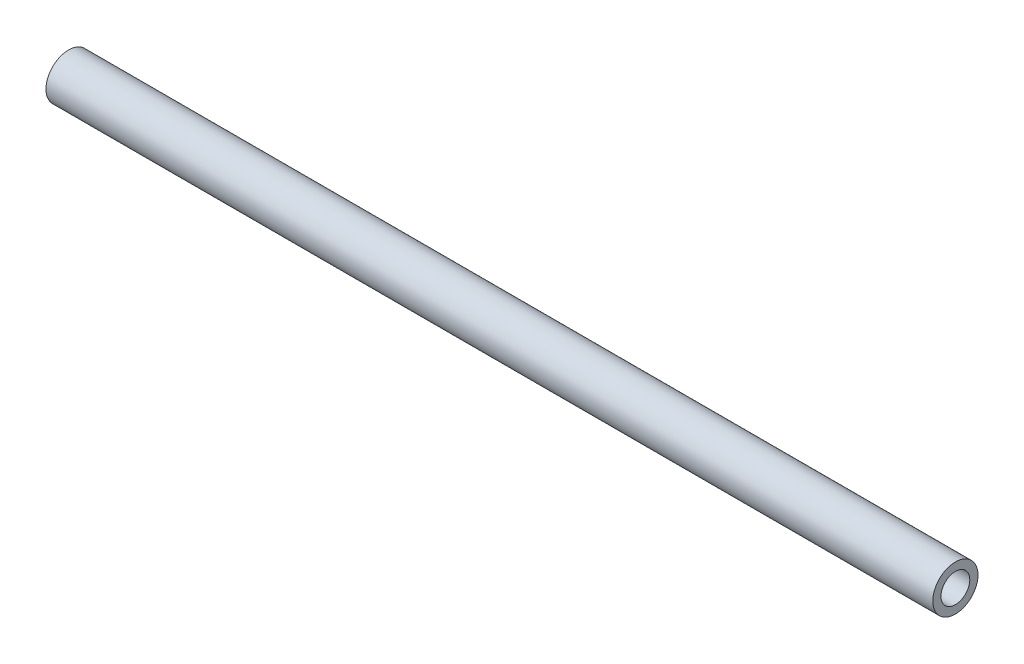
ISO-10303-21;
HEADER;
FILE_DESCRIPTION(('STEP AP214'),'2;1');
FILE_NAME('part.step','',(''),(''),'','','');
FILE_SCHEMA(('AUTOMOTIVE_DESIGN { 1 0 10303 214 1 1 1 1 }'));
ENDSEC;
DATA;
#1=APPLICATION_CONTEXT('core data for automotive mechanical design processes');
#2=APPLICATION_PROTOCOL_DEFINITION('international standard','automotive_design',2000,#1);
#3=PRODUCT_CONTEXT('',#1,'mechanical');
#4=PRODUCT('Part','Part','',(#3));
#5=PRODUCT_RELATED_PRODUCT_CATEGORY('part','',(#4));
#6=PRODUCT_DEFINITION_FORMATION('','',#4);
#7=PRODUCT_DEFINITION_CONTEXT('part definition',#1,'design');
#8=PRODUCT_DEFINITION('design','',#6,#7);
#9=PRODUCT_DEFINITION_SHAPE('','',#8);
#10=(LENGTH_UNIT() NAMED_UNIT(*) SI_UNIT(.MILLI.,.METRE.));
#11=(NAMED_UNIT(*) PLANE_ANGLE_UNIT() SI_UNIT($,.RADIAN.));
#12=(NAMED_UNIT(*) SI_UNIT($,.STERADIAN.) SOLID_ANGLE_UNIT());
#13=UNCERTAINTY_MEASURE_WITH_UNIT(LENGTH_MEASURE(1.E-05),#10,'distance_accuracy_value','');
#14=(GEOMETRIC_REPRESENTATION_CONTEXT(3) GLOBAL_UNCERTAINTY_ASSIGNED_CONTEXT((#13)) GLOBAL_UNIT_ASSIGNED_CONTEXT((#10,
#11,#12)) REPRESENTATION_CONTEXT('',''));
#15=CARTESIAN_POINT('',(0.,0.,0.));
#16=DIRECTION('',(0.,0.,1.));
#17=DIRECTION('',(1.,0.,0.));
#18=AXIS2_PLACEMENT_3D('',#15,#16,#17);
#19=CARTESIAN_POINT('',(200.,0.,0.));
#20=DIRECTION('',(1.,0.,0.));
#21=DIRECTION('',(0.,0.,-1.));
#22=AXIS2_PLACEMENT_3D('',#19,#20,#21);
#23=PLANE('',#22);
#24=CARTESIAN_POINT('',(200.,0.,0.));
#25=DIRECTION('',(1.,0.,0.));
#26=DIRECTION('',(0.,0.,-1.));
#27=AXIS2_PLACEMENT_3D('',#24,#25,#26);
#28=CIRCLE('',#27,5.1);
#29=CARTESIAN_POINT('',(200.,0.,-5.1));
#30=VERTEX_POINT('',#29);
#31=EDGE_CURVE('E10',#30,#30,#28,.T.);
#32=ORIENTED_EDGE('',*,*,#31,.T.);
#33=EDGE_LOOP('',(#32));
#34=FACE_BOUND('',#33,.T.);
#35=CARTESIAN_POINT('',(200.,0.,0.));
#36=DIRECTION('',(1.,0.,0.));
#37=DIRECTION('',(0.,0.,-1.));
#38=AXIS2_PLACEMENT_3D('',#35,#36,#37);
#39=CIRCLE('',#38,3.25);
#40=CARTESIAN_POINT('',(200.,0.,-3.25));
#41=VERTEX_POINT('',#40);
#42=EDGE_CURVE('E48',#41,#41,#39,.T.);
#43=ORIENTED_EDGE('',*,*,#42,.F.);
#44=EDGE_LOOP('',(#43));
#45=FACE_BOUND('',#44,.T.);
#46=ADVANCED_FACE('F37',(#34,#45),#23,.T.);
#47=CARTESIAN_POINT('',(0.,0.,0.));
#48=DIRECTION('',(1.,0.,0.));
#49=DIRECTION('',(0.,0.,-1.));
#50=AXIS2_PLACEMENT_3D('',#47,#48,#49);
#51=PLANE('',#50);
#52=CARTESIAN_POINT('',(0.,0.,0.));
#53=DIRECTION('',(1.,0.,0.));
#54=DIRECTION('',(0.,0.,-1.));
#55=AXIS2_PLACEMENT_3D('',#52,#53,#54);
#56=CIRCLE('',#55,5.1);
#57=CARTESIAN_POINT('',(0.,0.,-5.1));
#58=VERTEX_POINT('',#57);
#59=EDGE_CURVE('E41',#58,#58,#56,.T.);
#60=ORIENTED_EDGE('',*,*,#59,.F.);
#61=EDGE_LOOP('',(#60));
#62=FACE_BOUND('',#61,.T.);
#63=CARTESIAN_POINT('',(0.,0.,0.));
#64=DIRECTION('',(1.,0.,0.));
#65=DIRECTION('',(0.,0.,-1.));
#66=AXIS2_PLACEMENT_3D('',#63,#64,#65);
#67=CIRCLE('',#66,3.25);
#68=CARTESIAN_POINT('',(0.,0.,-3.25));
#69=VERTEX_POINT('',#68);
#70=EDGE_CURVE('E50',#69,#69,#67,.T.);
#71=ORIENTED_EDGE('',*,*,#70,.T.);
#72=EDGE_LOOP('',(#71));
#73=FACE_BOUND('',#72,.T.);
#74=ADVANCED_FACE('F60',(#62,#73),#51,.F.);
#75=CARTESIAN_POINT('',(200.,0.,0.));
#76=DIRECTION('',(-1.,0.,0.));
#77=DIRECTION('',(0.,0.,1.));
#78=AXIS2_PLACEMENT_3D('',#75,#76,#77);
#79=CYLINDRICAL_SURFACE('',#78,5.1);
#80=ORIENTED_EDGE('',*,*,#31,.F.);
#81=EDGE_LOOP('',(#80));
#82=FACE_BOUND('',#81,.T.);
#83=ORIENTED_EDGE('',*,*,#59,.T.);
#84=EDGE_LOOP('',(#83));
#85=FACE_BOUND('',#84,.T.);
#86=ADVANCED_FACE('F39',(#82,#85),#79,.T.);
#87=CARTESIAN_POINT('',(200.,0.,0.));
#88=DIRECTION('',(-1.,0.,0.));
#89=DIRECTION('',(0.,0.,1.));
#90=AXIS2_PLACEMENT_3D('',#87,#88,#89);
#91=CYLINDRICAL_SURFACE('',#90,3.25);
#92=ORIENTED_EDGE('',*,*,#42,.T.);
#93=EDGE_LOOP('',(#92));
#94=FACE_BOUND('',#93,.T.);
#95=ORIENTED_EDGE('',*,*,#70,.F.);
#96=EDGE_LOOP('',(#95));
#97=FACE_BOUND('',#96,.T.);
#98=ADVANCED_FACE('F56',(#94,#97),#91,.F.);
#99=CLOSED_SHELL('',(#46,#74,#86,#98));
#100=MANIFOLD_SOLID_BREP('B2',#99);
#101=ADVANCED_BREP_SHAPE_REPRESENTATION('',(#18,#100),#14);
#102=SHAPE_DEFINITION_REPRESENTATION(#9,#101);
ENDSEC;
END-ISO-10303-21;
